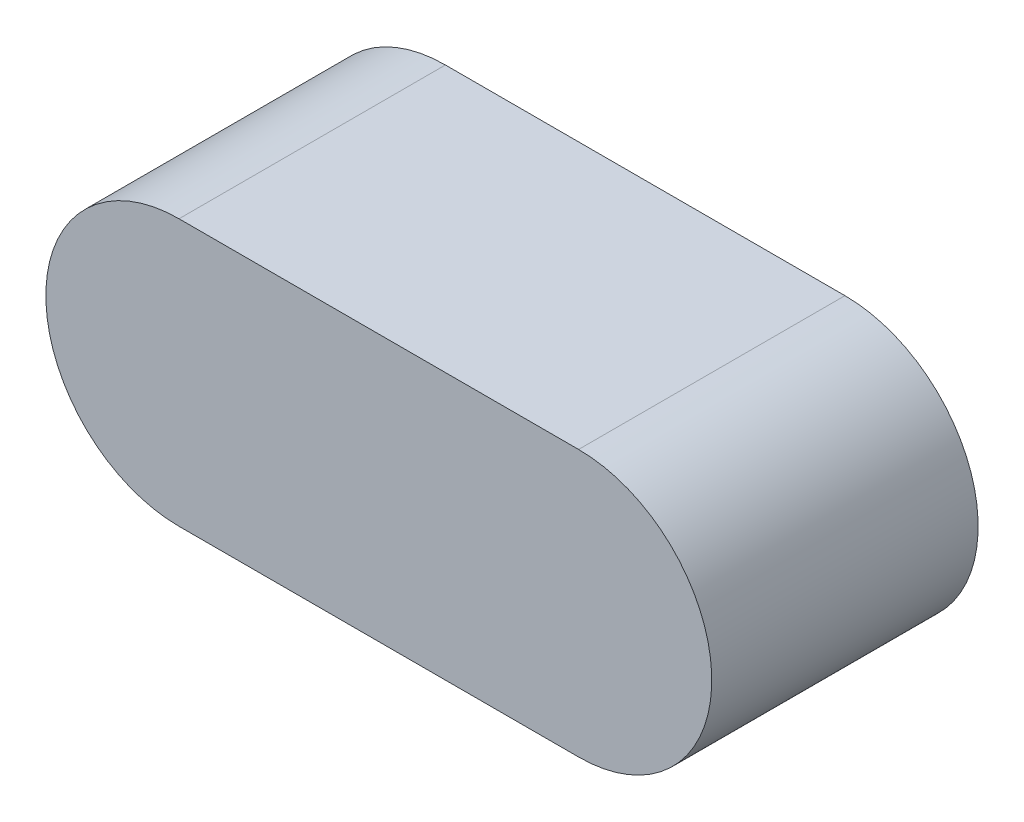
ISO-10303-21;
HEADER;
FILE_DESCRIPTION(('STEP AP214'),'2;1');
FILE_NAME('part.step','',(''),(''),'','','');
FILE_SCHEMA(('AUTOMOTIVE_DESIGN { 1 0 10303 214 1 1 1 1 }'));
ENDSEC;
DATA;
#1=APPLICATION_CONTEXT('core data for automotive mechanical design processes');
#2=APPLICATION_PROTOCOL_DEFINITION('international standard','automotive_design',2000,#1);
#3=PRODUCT_CONTEXT('',#1,'mechanical');
#4=PRODUCT('Part','Part','',(#3));
#5=PRODUCT_RELATED_PRODUCT_CATEGORY('part','',(#4));
#6=PRODUCT_DEFINITION_FORMATION('','',#4);
#7=PRODUCT_DEFINITION_CONTEXT('part definition',#1,'design');
#8=PRODUCT_DEFINITION('design','',#6,#7);
#9=PRODUCT_DEFINITION_SHAPE('','',#8);
#10=(LENGTH_UNIT() NAMED_UNIT(*) SI_UNIT(.MILLI.,.METRE.));
#11=(NAMED_UNIT(*) PLANE_ANGLE_UNIT() SI_UNIT($,.RADIAN.));
#12=(NAMED_UNIT(*) SI_UNIT($,.STERADIAN.) SOLID_ANGLE_UNIT());
#13=UNCERTAINTY_MEASURE_WITH_UNIT(LENGTH_MEASURE(1.E-05),#10,'distance_accuracy_value','');
#14=(GEOMETRIC_REPRESENTATION_CONTEXT(3) GLOBAL_UNCERTAINTY_ASSIGNED_CONTEXT((#13)) GLOBAL_UNIT_ASSIGNED_CONTEXT((#10,
#11,#12)) REPRESENTATION_CONTEXT('',''));
#15=CARTESIAN_POINT('',(0.,0.,0.));
#16=DIRECTION('',(0.,0.,1.));
#17=DIRECTION('',(1.,0.,0.));
#18=AXIS2_PLACEMENT_3D('',#15,#16,#17);
#19=CARTESIAN_POINT('',(0.,0.,4.));
#20=DIRECTION('',(0.,0.,-1.));
#21=DIRECTION('',(-1.,0.,0.));
#22=AXIS2_PLACEMENT_3D('',#19,#20,#21);
#23=CYLINDRICAL_SURFACE('',#22,2.);
#24=CARTESIAN_POINT('',(0.,0.,0.));
#25=DIRECTION('',(0.,0.,1.));
#26=DIRECTION('',(1.,0.,0.));
#27=AXIS2_PLACEMENT_3D('',#24,#25,#26);
#28=CIRCLE('',#27,2.);
#29=CARTESIAN_POINT('',(0.,2.,0.));
#30=VERTEX_POINT('',#29);
#31=CARTESIAN_POINT('',(0.,-2.,0.));
#32=VERTEX_POINT('',#31);
#33=EDGE_CURVE('E107',#30,#32,#28,.T.);
#34=ORIENTED_EDGE('',*,*,#33,.T.);
#35=DIRECTION('',(0.,0.,-1.));
#36=VECTOR('',#35,1.);
#37=CARTESIAN_POINT('',(0.,-2.,4.));
#38=LINE('',#37,#36);
#39=CARTESIAN_POINT('',(0.,-2.,4.));
#40=VERTEX_POINT('',#39);
#41=EDGE_CURVE('E11',#40,#32,#38,.T.);
#42=ORIENTED_EDGE('',*,*,#41,.F.);
#43=CARTESIAN_POINT('',(0.,0.,4.));
#44=DIRECTION('',(0.,0.,1.));
#45=DIRECTION('',(1.,0.,0.));
#46=AXIS2_PLACEMENT_3D('',#43,#44,#45);
#47=CIRCLE('',#46,2.);
#48=CARTESIAN_POINT('',(0.,2.,4.));
#49=VERTEX_POINT('',#48);
#50=EDGE_CURVE('E91',#49,#40,#47,.T.);
#51=ORIENTED_EDGE('',*,*,#50,.F.);
#52=DIRECTION('',(0.,0.,-1.));
#53=VECTOR('',#52,1.);
#54=CARTESIAN_POINT('',(0.,2.,4.));
#55=LINE('',#54,#53);
#56=EDGE_CURVE('E103',#49,#30,#55,.T.);
#57=ORIENTED_EDGE('',*,*,#56,.T.);
#58=EDGE_LOOP('',(#34,#42,#51,#57));
#59=FACE_BOUND('',#58,.T.);
#60=ADVANCED_FACE('F39',(#59),#23,.T.);
#61=CARTESIAN_POINT('',(0.,-2.,4.));
#62=DIRECTION('',(0.,1.,0.));
#63=DIRECTION('',(0.,0.,1.));
#64=AXIS2_PLACEMENT_3D('',#61,#62,#63);
#65=PLANE('',#64);
#66=DIRECTION('',(1.,0.,0.));
#67=VECTOR('',#66,1.);
#68=CARTESIAN_POINT('',(0.,-2.,0.));
#69=LINE('',#68,#67);
#70=CARTESIAN_POINT('',(6.,-2.,0.));
#71=VERTEX_POINT('',#70);
#72=EDGE_CURVE('E96',#32,#71,#69,.T.);
#73=ORIENTED_EDGE('',*,*,#72,.T.);
#74=DIRECTION('',(0.,0.,-1.));
#75=VECTOR('',#74,1.);
#76=CARTESIAN_POINT('',(6.,-2.,4.));
#77=LINE('',#76,#75);
#78=CARTESIAN_POINT('',(6.,-2.,4.));
#79=VERTEX_POINT('',#78);
#80=EDGE_CURVE('E48',#79,#71,#77,.T.);
#81=ORIENTED_EDGE('',*,*,#80,.F.);
#82=DIRECTION('',(1.,0.,0.));
#83=VECTOR('',#82,1.);
#84=CARTESIAN_POINT('',(0.,-2.,4.));
#85=LINE('',#84,#83);
#86=EDGE_CURVE('E86',#40,#79,#85,.T.);
#87=ORIENTED_EDGE('',*,*,#86,.F.);
#88=ORIENTED_EDGE('',*,*,#41,.T.);
#89=EDGE_LOOP('',(#73,#81,#87,#88));
#90=FACE_BOUND('',#89,.T.);
#91=ADVANCED_FACE('F95',(#90),#65,.F.);
#92=CARTESIAN_POINT('',(6.,0.,4.));
#93=DIRECTION('',(0.,0.,-1.));
#94=DIRECTION('',(-1.,0.,0.));
#95=AXIS2_PLACEMENT_3D('',#92,#93,#94);
#96=CYLINDRICAL_SURFACE('',#95,2.);
#97=CARTESIAN_POINT('',(6.,0.,0.));
#98=DIRECTION('',(0.,0.,1.));
#99=DIRECTION('',(1.,0.,0.));
#100=AXIS2_PLACEMENT_3D('',#97,#98,#99);
#101=CIRCLE('',#100,2.);
#102=CARTESIAN_POINT('',(6.,2.,0.));
#103=VERTEX_POINT('',#102);
#104=EDGE_CURVE('E73',#71,#103,#101,.T.);
#105=ORIENTED_EDGE('',*,*,#104,.T.);
#106=DIRECTION('',(0.,0.,-1.));
#107=VECTOR('',#106,1.);
#108=CARTESIAN_POINT('',(6.,2.,4.));
#109=LINE('',#108,#107);
#110=CARTESIAN_POINT('',(6.,2.,4.));
#111=VERTEX_POINT('',#110);
#112=EDGE_CURVE('E98',#111,#103,#109,.T.);
#113=ORIENTED_EDGE('',*,*,#112,.F.);
#114=CARTESIAN_POINT('',(6.,0.,4.));
#115=DIRECTION('',(0.,0.,1.));
#116=DIRECTION('',(1.,0.,0.));
#117=AXIS2_PLACEMENT_3D('',#114,#115,#116);
#118=CIRCLE('',#117,2.);
#119=EDGE_CURVE('E89',#79,#111,#118,.T.);
#120=ORIENTED_EDGE('',*,*,#119,.F.);
#121=ORIENTED_EDGE('',*,*,#80,.T.);
#122=EDGE_LOOP('',(#105,#113,#120,#121));
#123=FACE_BOUND('',#122,.T.);
#124=ADVANCED_FACE('F99',(#123),#96,.T.);
#125=CARTESIAN_POINT('',(0.,2.,4.));
#126=DIRECTION('',(0.,-1.,0.));
#127=DIRECTION('',(0.,0.,-1.));
#128=AXIS2_PLACEMENT_3D('',#125,#126,#127);
#129=PLANE('',#128);
#130=DIRECTION('',(-1.,0.,0.));
#131=VECTOR('',#130,1.);
#132=CARTESIAN_POINT('',(0.,2.,0.));
#133=LINE('',#132,#131);
#134=EDGE_CURVE('E79',#103,#30,#133,.T.);
#135=ORIENTED_EDGE('',*,*,#134,.T.);
#136=ORIENTED_EDGE('',*,*,#56,.F.);
#137=DIRECTION('',(-1.,0.,0.));
#138=VECTOR('',#137,1.);
#139=CARTESIAN_POINT('',(0.,2.,4.));
#140=LINE('',#139,#138);
#141=EDGE_CURVE('E56',#111,#49,#140,.T.);
#142=ORIENTED_EDGE('',*,*,#141,.F.);
#143=ORIENTED_EDGE('',*,*,#112,.T.);
#144=EDGE_LOOP('',(#135,#136,#142,#143));
#145=FACE_BOUND('',#144,.T.);
#146=ADVANCED_FACE('F120',(#145),#129,.F.);
#147=CARTESIAN_POINT('',(0.,0.,4.));
#148=DIRECTION('',(0.,0.,1.));
#149=DIRECTION('',(1.,0.,0.));
#150=AXIS2_PLACEMENT_3D('',#147,#148,#149);
#151=PLANE('',#150);
#152=ORIENTED_EDGE('',*,*,#50,.T.);
#153=ORIENTED_EDGE('',*,*,#86,.T.);
#154=ORIENTED_EDGE('',*,*,#119,.T.);
#155=ORIENTED_EDGE('',*,*,#141,.T.);
#156=EDGE_LOOP('',(#152,#153,#154,#155));
#157=FACE_BOUND('',#156,.T.);
#158=ADVANCED_FACE('F87',(#157),#151,.T.);
#159=CARTESIAN_POINT('',(0.,0.,0.));
#160=DIRECTION('',(0.,0.,1.));
#161=DIRECTION('',(1.,0.,0.));
#162=AXIS2_PLACEMENT_3D('',#159,#160,#161);
#163=PLANE('',#162);
#164=ORIENTED_EDGE('',*,*,#33,.F.);
#165=ORIENTED_EDGE('',*,*,#134,.F.);
#166=ORIENTED_EDGE('',*,*,#104,.F.);
#167=ORIENTED_EDGE('',*,*,#72,.F.);
#168=EDGE_LOOP('',(#164,#165,#166,#167));
#169=FACE_BOUND('',#168,.T.);
#170=ADVANCED_FACE('F123',(#169),#163,.F.);
#171=CLOSED_SHELL('',(#60,#91,#124,#146,#158,#170));
#172=MANIFOLD_SOLID_BREP('B2',#171);
#173=ADVANCED_BREP_SHAPE_REPRESENTATION('',(#18,#172),#14);
#174=SHAPE_DEFINITION_REPRESENTATION(#9,#173);
ENDSEC;
END-ISO-10303-21;
